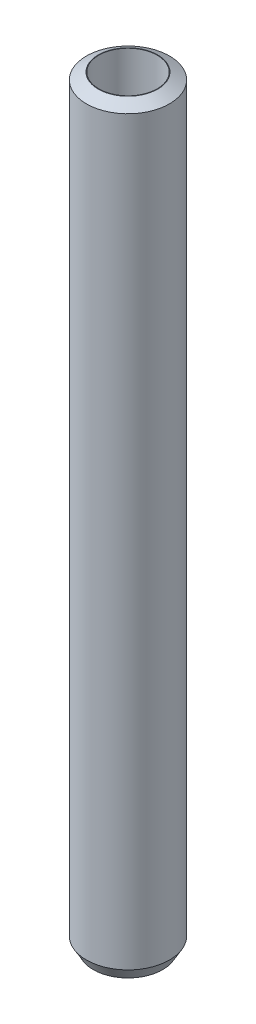
ISO-10303-21;
HEADER;
FILE_DESCRIPTION(('STEP AP214'),'2;1');
FILE_NAME('part.step','',(''),(''),'','','');
FILE_SCHEMA(('AUTOMOTIVE_DESIGN { 1 0 10303 214 1 1 1 1 }'));
ENDSEC;
DATA;
#1=APPLICATION_CONTEXT('core data for automotive mechanical design processes');
#2=APPLICATION_PROTOCOL_DEFINITION('international standard','automotive_design',2000,#1);
#3=PRODUCT_CONTEXT('',#1,'mechanical');
#4=PRODUCT('Part','Part','',(#3));
#5=PRODUCT_RELATED_PRODUCT_CATEGORY('part','',(#4));
#6=PRODUCT_DEFINITION_FORMATION('','',#4);
#7=PRODUCT_DEFINITION_CONTEXT('part definition',#1,'design');
#8=PRODUCT_DEFINITION('design','',#6,#7);
#9=PRODUCT_DEFINITION_SHAPE('','',#8);
#10=(LENGTH_UNIT() NAMED_UNIT(*) SI_UNIT(.MILLI.,.METRE.));
#11=(NAMED_UNIT(*) PLANE_ANGLE_UNIT() SI_UNIT($,.RADIAN.));
#12=(NAMED_UNIT(*) SI_UNIT($,.STERADIAN.) SOLID_ANGLE_UNIT());
#13=UNCERTAINTY_MEASURE_WITH_UNIT(LENGTH_MEASURE(1.E-05),#10,'distance_accuracy_value','');
#14=(GEOMETRIC_REPRESENTATION_CONTEXT(3) GLOBAL_UNCERTAINTY_ASSIGNED_CONTEXT((#13)) GLOBAL_UNIT_ASSIGNED_CONTEXT((#10,
#11,#12)) REPRESENTATION_CONTEXT('',''));
#15=CARTESIAN_POINT('',(0.,0.,0.));
#16=DIRECTION('',(0.,0.,1.));
#17=DIRECTION('',(1.,0.,0.));
#18=AXIS2_PLACEMENT_3D('',#15,#16,#17);
#19=CARTESIAN_POINT('',(0.,457.707368057705,0.));
#20=DIRECTION('',(0.,-1.,0.));
#21=DIRECTION('',(0.,0.,-1.));
#22=AXIS2_PLACEMENT_3D('',#19,#20,#21);
#23=CYLINDRICAL_SURFACE('',#22,25.);
#24=CARTESIAN_POINT('',(0.,453.597469554639,0.));
#25=DIRECTION('',(0.,1.,0.));
#26=DIRECTION('',(0.,0.,1.));
#27=AXIS2_PLACEMENT_3D('',#24,#25,#26);
#28=CIRCLE('',#27,25.);
#29=CARTESIAN_POINT('',(0.,453.597469554639,25.));
#30=VERTEX_POINT('',#29);
#31=EDGE_CURVE('E50',#30,#30,#28,.F.);
#32=ORIENTED_EDGE('',*,*,#31,.T.);
#33=EDGE_LOOP('',(#32));
#34=FACE_BOUND('',#33,.T.);
#35=CARTESIAN_POINT('',(0.,7.11855302126135,0.));
#36=DIRECTION('',(0.,1.,0.));
#37=DIRECTION('',(0.,0.,1.));
#38=AXIS2_PLACEMENT_3D('',#35,#36,#37);
#39=CIRCLE('',#38,25.);
#40=CARTESIAN_POINT('',(0.,7.11855302126135,25.));
#41=VERTEX_POINT('',#40);
#42=EDGE_CURVE('E51',#41,#41,#39,.T.);
#43=ORIENTED_EDGE('',*,*,#42,.T.);
#44=EDGE_LOOP('',(#43));
#45=FACE_BOUND('',#44,.T.);
#46=ADVANCED_FACE('F39',(#34,#45),#23,.T.);
#47=CARTESIAN_POINT('',(0.,457.707368057705,0.));
#48=DIRECTION('',(0.,1.,0.));
#49=DIRECTION('',(0.,0.,1.));
#50=AXIS2_PLACEMENT_3D('',#47,#48,#49);
#51=PLANE('',#50);
#52=CARTESIAN_POINT('',(0.,457.707368057705,0.));
#53=DIRECTION('',(0.,1.,0.));
#54=DIRECTION('',(0.,0.,1.));
#55=AXIS2_PLACEMENT_3D('',#52,#53,#54);
#56=CIRCLE('',#55,17.8814469787385);
#57=CARTESIAN_POINT('',(0.,457.707368057705,17.8814469787385));
#58=VERTEX_POINT('',#57);
#59=EDGE_CURVE('E54',#58,#58,#56,.T.);
#60=ORIENTED_EDGE('',*,*,#59,.T.);
#61=EDGE_LOOP('',(#60));
#62=FACE_BOUND('',#61,.T.);
#63=CARTESIAN_POINT('',(0.,457.707368057705,0.));
#64=DIRECTION('',(0.,1.,0.));
#65=DIRECTION('',(0.,0.,1.));
#66=AXIS2_PLACEMENT_3D('',#63,#64,#65);
#67=CIRCLE('',#66,17.5719395549602);
#68=CARTESIAN_POINT('',(0.,457.707368057705,17.5719395549602));
#69=VERTEX_POINT('',#68);
#70=EDGE_CURVE('E58',#69,#69,#67,.T.);
#71=ORIENTED_EDGE('',*,*,#70,.F.);
#72=EDGE_LOOP('',(#71));
#73=FACE_BOUND('',#72,.T.);
#74=ADVANCED_FACE('F69',(#62,#73),#51,.T.);
#75=CARTESIAN_POINT('',(0.,0.,0.));
#76=DIRECTION('',(0.,1.,0.));
#77=DIRECTION('',(0.,0.,1.));
#78=AXIS2_PLACEMENT_3D('',#75,#76,#77);
#79=PLANE('',#78);
#80=CARTESIAN_POINT('',(0.,0.,0.));
#81=DIRECTION('',(0.,1.,0.));
#82=DIRECTION('',(0.,0.,1.));
#83=AXIS2_PLACEMENT_3D('',#80,#81,#82);
#84=CIRCLE('',#83,20.8901014969341);
#85=CARTESIAN_POINT('',(0.,0.,20.8901014969341));
#86=VERTEX_POINT('',#85);
#87=EDGE_CURVE('E10',#86,#86,#84,.F.);
#88=ORIENTED_EDGE('',*,*,#87,.T.);
#89=EDGE_LOOP('',(#88));
#90=FACE_BOUND('',#89,.T.);
#91=CARTESIAN_POINT('',(0.,0.,0.));
#92=DIRECTION('',(0.,1.,0.));
#93=DIRECTION('',(0.,0.,1.));
#94=AXIS2_PLACEMENT_3D('',#91,#92,#93);
#95=CIRCLE('',#94,17.5719395549602);
#96=CARTESIAN_POINT('',(0.,0.,17.5719395549602));
#97=VERTEX_POINT('',#96);
#98=EDGE_CURVE('E63',#97,#97,#95,.T.);
#99=ORIENTED_EDGE('',*,*,#98,.T.);
#100=EDGE_LOOP('',(#99));
#101=FACE_BOUND('',#100,.T.);
#102=ADVANCED_FACE('F75',(#90,#101),#79,.F.);
#103=CARTESIAN_POINT('',(0.,457.707368057705,0.));
#104=DIRECTION('',(0.,-1.,0.));
#105=DIRECTION('',(0.,0.,-1.));
#106=AXIS2_PLACEMENT_3D('',#103,#104,#105);
#107=CYLINDRICAL_SURFACE('',#106,17.5719395549602);
#108=ORIENTED_EDGE('',*,*,#70,.T.);
#109=EDGE_LOOP('',(#108));
#110=FACE_BOUND('',#109,.T.);
#111=ORIENTED_EDGE('',*,*,#98,.F.);
#112=EDGE_LOOP('',(#111));
#113=FACE_BOUND('',#112,.T.);
#114=ADVANCED_FACE('F70',(#110,#113),#107,.F.);
#115=CARTESIAN_POINT('',(0.,457.707368057705,0.));
#116=DIRECTION('',(0.,-1.,0.));
#117=DIRECTION('',(0.,0.,-1.));
#118=AXIS2_PLACEMENT_3D('',#115,#116,#117);
#119=CONICAL_SURFACE('',#118,17.8814469787385,1.04719755119659);
#120=ORIENTED_EDGE('',*,*,#31,.F.);
#121=EDGE_LOOP('',(#120));
#122=FACE_BOUND('',#121,.T.);
#123=ORIENTED_EDGE('',*,*,#59,.F.);
#124=EDGE_LOOP('',(#123));
#125=FACE_BOUND('',#124,.T.);
#126=ADVANCED_FACE('F81',(#122,#125),#119,.T.);
#127=CARTESIAN_POINT('',(0.,7.11855302126135,0.));
#128=DIRECTION('',(0.,1.,0.));
#129=DIRECTION('',(0.,0.,1.));
#130=AXIS2_PLACEMENT_3D('',#127,#128,#129);
#131=CONICAL_SURFACE('',#130,25.,0.5235987755983);
#132=ORIENTED_EDGE('',*,*,#87,.F.);
#133=EDGE_LOOP('',(#132));
#134=FACE_BOUND('',#133,.T.);
#135=ORIENTED_EDGE('',*,*,#42,.F.);
#136=EDGE_LOOP('',(#135));
#137=FACE_BOUND('',#136,.T.);
#138=ADVANCED_FACE('F45',(#134,#137),#131,.T.);
#139=CLOSED_SHELL('',(#46,#74,#102,#114,#126,#138));
#140=MANIFOLD_SOLID_BREP('B2',#139);
#141=ADVANCED_BREP_SHAPE_REPRESENTATION('',(#18,#140),#14);
#142=SHAPE_DEFINITION_REPRESENTATION(#9,#141);
ENDSEC;
END-ISO-10303-21;
